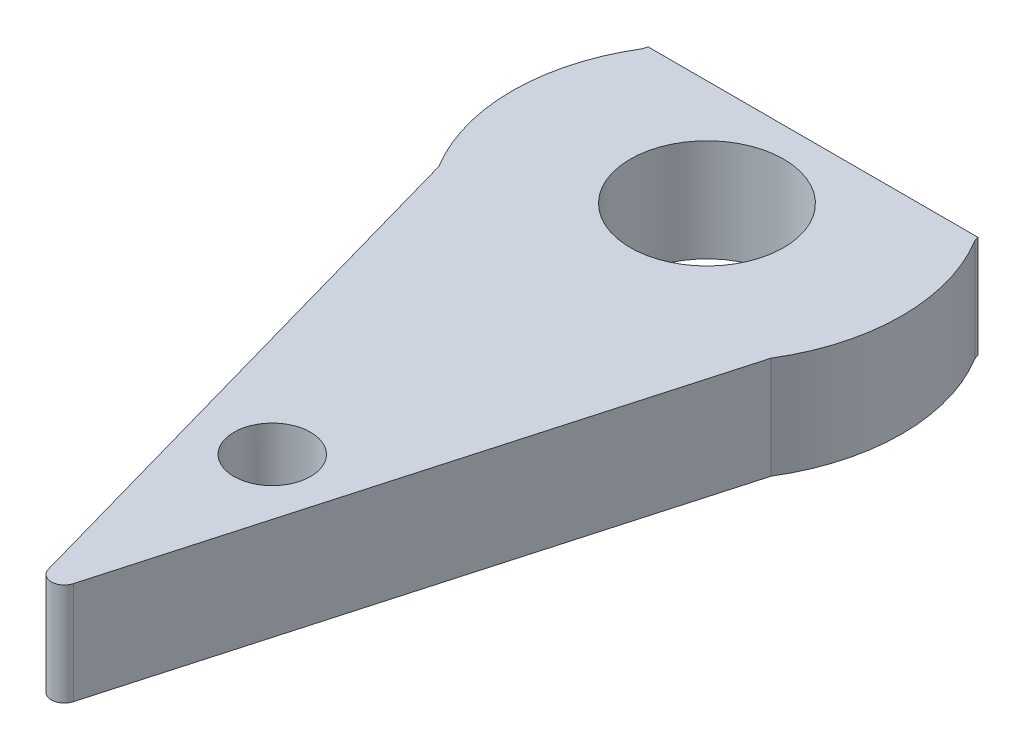
ISO-10303-21;
HEADER;
FILE_DESCRIPTION(('STEP AP214'),'2;1');
FILE_NAME('part.step','',(''),(''),'','','');
FILE_SCHEMA(('AUTOMOTIVE_DESIGN { 1 0 10303 214 1 1 1 1 }'));
ENDSEC;
DATA;
#1=APPLICATION_CONTEXT('core data for automotive mechanical design processes');
#2=APPLICATION_PROTOCOL_DEFINITION('international standard','automotive_design',2000,#1);
#3=PRODUCT_CONTEXT('',#1,'mechanical');
#4=PRODUCT('Part','Part','',(#3));
#5=PRODUCT_RELATED_PRODUCT_CATEGORY('part','',(#4));
#6=PRODUCT_DEFINITION_FORMATION('','',#4);
#7=PRODUCT_DEFINITION_CONTEXT('part definition',#1,'design');
#8=PRODUCT_DEFINITION('design','',#6,#7);
#9=PRODUCT_DEFINITION_SHAPE('','',#8);
#10=(LENGTH_UNIT() NAMED_UNIT(*) SI_UNIT(.MILLI.,.METRE.));
#11=(NAMED_UNIT(*) PLANE_ANGLE_UNIT() SI_UNIT($,.RADIAN.));
#12=(NAMED_UNIT(*) SI_UNIT($,.STERADIAN.) SOLID_ANGLE_UNIT());
#13=UNCERTAINTY_MEASURE_WITH_UNIT(LENGTH_MEASURE(1.E-05),#10,'distance_accuracy_value','');
#14=(GEOMETRIC_REPRESENTATION_CONTEXT(3) GLOBAL_UNCERTAINTY_ASSIGNED_CONTEXT((#13)) GLOBAL_UNIT_ASSIGNED_CONTEXT((#10,
#11,#12)) REPRESENTATION_CONTEXT('',''));
#15=CARTESIAN_POINT('',(0.,0.,0.));
#16=DIRECTION('',(0.,0.,1.));
#17=DIRECTION('',(1.,0.,0.));
#18=AXIS2_PLACEMENT_3D('',#15,#16,#17);
#19=CARTESIAN_POINT('',(0.,2.,0.));
#20=DIRECTION('',(0.,1.,0.));
#21=DIRECTION('',(0.,0.,1.));
#22=AXIS2_PLACEMENT_3D('',#19,#20,#21);
#23=PLANE('',#22);
#24=CARTESIAN_POINT('',(0.,2.,8.5));
#25=DIRECTION('',(0.,1.,0.));
#26=DIRECTION('',(0.,0.,-1.));
#27=AXIS2_PLACEMENT_3D('',#24,#25,#26);
#28=CIRCLE('',#27,0.75);
#29=CARTESIAN_POINT('',(0.,2.,7.75));
#30=VERTEX_POINT('',#29);
#31=EDGE_CURVE('E311',#30,#30,#28,.T.);
#32=ORIENTED_EDGE('',*,*,#31,.F.);
#33=EDGE_LOOP('',(#32));
#34=FACE_BOUND('',#33,.T.);
#35=CARTESIAN_POINT('',(0.,2.,0.));
#36=DIRECTION('',(0.,-1.,0.));
#37=DIRECTION('',(0.,0.,-1.));
#38=AXIS2_PLACEMENT_3D('',#35,#36,#37);
#39=CIRCLE('',#38,1.5);
#40=CARTESIAN_POINT('',(0.,2.,-1.5));
#41=VERTEX_POINT('',#40);
#42=EDGE_CURVE('E306',#41,#41,#39,.T.);
#43=ORIENTED_EDGE('',*,*,#42,.T.);
#44=EDGE_LOOP('',(#43));
#45=FACE_BOUND('',#44,.T.);
#46=DIRECTION('',(-0.271612552445606,0.,-0.962406681893878));
#47=VECTOR('',#46,1.);
#48=CARTESIAN_POINT('',(3.52892342735868,2.,-0.995940611721226));
#49=LINE('',#48,#47);
#50=CARTESIAN_POINT('',(3.24784685471735,2.,-1.99188122344245));
#51=VERTEX_POINT('',#50);
#52=CARTESIAN_POINT('',(3.2243272897343,2.,-2.07521826472098));
#53=VERTEX_POINT('',#52);
#54=EDGE_CURVE('E131',#51,#53,#49,.T.);
#55=ORIENTED_EDGE('',*,*,#54,.T.);
#56=DIRECTION('',(-1.,0.,0.));
#57=VECTOR('',#56,1.);
#58=CARTESIAN_POINT('',(0.,2.,-2.07521826472098));
#59=LINE('',#58,#57);
#60=CARTESIAN_POINT('',(-3.2243272897343,2.,-2.07521826472098));
#61=VERTEX_POINT('',#60);
#62=EDGE_CURVE('E103',#53,#61,#59,.T.);
#63=ORIENTED_EDGE('',*,*,#62,.T.);
#64=DIRECTION('',(-0.271612552445606,0.,0.962406681893878));
#65=VECTOR('',#64,1.);
#66=CARTESIAN_POINT('',(-3.52892342735868,2.,-0.995940611721226));
#67=LINE('',#66,#65);
#68=CARTESIAN_POINT('',(-3.24784685471735,2.,-1.99188122344245));
#69=VERTEX_POINT('',#68);
#70=EDGE_CURVE('E133',#61,#69,#67,.T.);
#71=ORIENTED_EDGE('',*,*,#70,.T.);
#72=CARTESIAN_POINT('',(0.,2.,0.));
#73=DIRECTION('',(0.,1.,0.));
#74=DIRECTION('',(0.,0.,1.));
#75=AXIS2_PLACEMENT_3D('',#72,#73,#74);
#76=CIRCLE('',#75,3.81);
#77=CARTESIAN_POINT('',(-3.24784685471735,2.,1.99188122344245));
#78=VERTEX_POINT('',#77);
#79=EDGE_CURVE('E156',#69,#78,#76,.T.);
#80=ORIENTED_EDGE('',*,*,#79,.T.);
#81=DIRECTION('',(-0.271612552445606,0.,-0.962406681893878));
#82=VECTOR('',#81,1.);
#83=CARTESIAN_POINT('',(-3.52892342735868,2.,0.995940611721226));
#84=LINE('',#83,#82);
#85=CARTESIAN_POINT('',(-0.244451297201043,2.,12.6338339862955));
#86=VERTEX_POINT('',#85);
#87=EDGE_CURVE('E145',#86,#78,#84,.T.);
#88=ORIENTED_EDGE('',*,*,#87,.F.);
#89=CARTESIAN_POINT('',(0.,2.,12.5648443979743));
#90=DIRECTION('',(0.,1.,0.));
#91=DIRECTION('',(0.,0.,1.));
#92=AXIS2_PLACEMENT_3D('',#89,#90,#91);
#93=CIRCLE('',#92,0.254);
#94=CARTESIAN_POINT('',(0.244451297201043,2.,12.6338339862955));
#95=VERTEX_POINT('',#94);
#96=EDGE_CURVE('E161',#86,#95,#93,.T.);
#97=ORIENTED_EDGE('',*,*,#96,.T.);
#98=DIRECTION('',(-0.271612552445606,0.,0.962406681893878));
#99=VECTOR('',#98,1.);
#100=CARTESIAN_POINT('',(3.52892342735868,2.,0.995940611721226));
#101=LINE('',#100,#99);
#102=CARTESIAN_POINT('',(3.24784685471735,2.,1.99188122344245));
#103=VERTEX_POINT('',#102);
#104=EDGE_CURVE('E123',#103,#95,#101,.T.);
#105=ORIENTED_EDGE('',*,*,#104,.F.);
#106=EDGE_CURVE('E152',#103,#51,#76,.T.);
#107=ORIENTED_EDGE('',*,*,#106,.T.);
#108=EDGE_LOOP('',(#55,#63,#71,#80,#88,#97,#105,#107));
#109=FACE_BOUND('',#108,.T.);
#110=ADVANCED_FACE('F37',(#34,#45,#109),#23,.T.);
#111=CARTESIAN_POINT('',(0.,0.,0.));
#112=DIRECTION('',(0.,1.,0.));
#113=DIRECTION('',(0.,0.,1.));
#114=AXIS2_PLACEMENT_3D('',#111,#112,#113);
#115=PLANE('',#114);
#116=CARTESIAN_POINT('',(0.,0.,8.5));
#117=DIRECTION('',(0.,1.,0.));
#118=DIRECTION('',(0.,0.,1.));
#119=AXIS2_PLACEMENT_3D('',#116,#117,#118);
#120=CIRCLE('',#119,0.75);
#121=CARTESIAN_POINT('',(0.,0.,9.25));
#122=VERTEX_POINT('',#121);
#123=EDGE_CURVE('E129',#122,#122,#120,.F.);
#124=ORIENTED_EDGE('',*,*,#123,.F.);
#125=EDGE_LOOP('',(#124));
#126=FACE_BOUND('',#125,.T.);
#127=CARTESIAN_POINT('',(0.,0.,0.));
#128=DIRECTION('',(0.,-1.,0.));
#129=DIRECTION('',(0.,0.,-1.));
#130=AXIS2_PLACEMENT_3D('',#127,#128,#129);
#131=CIRCLE('',#130,1.5);
#132=CARTESIAN_POINT('',(0.,0.,-1.5));
#133=VERTEX_POINT('',#132);
#134=EDGE_CURVE('E108',#133,#133,#131,.T.);
#135=ORIENTED_EDGE('',*,*,#134,.F.);
#136=EDGE_LOOP('',(#135));
#137=FACE_BOUND('',#136,.T.);
#138=DIRECTION('',(1.,0.,0.));
#139=VECTOR('',#138,1.);
#140=CARTESIAN_POINT('',(5.4306501931921,0.,-2.07521826472098));
#141=LINE('',#140,#139);
#142=CARTESIAN_POINT('',(-3.2243272897343,0.,-2.07521826472098));
#143=VERTEX_POINT('',#142);
#144=CARTESIAN_POINT('',(3.2243272897343,0.,-2.07521826472098));
#145=VERTEX_POINT('',#144);
#146=EDGE_CURVE('E52',#143,#145,#141,.T.);
#147=ORIENTED_EDGE('',*,*,#146,.T.);
#148=DIRECTION('',(0.271612552445605,0.,0.962406681893878));
#149=VECTOR('',#148,1.);
#150=CARTESIAN_POINT('',(3.52892342735868,0.,-0.995940611721226));
#151=LINE('',#150,#149);
#152=CARTESIAN_POINT('',(3.24784685471735,0.,-1.99188122344245));
#153=VERTEX_POINT('',#152);
#154=EDGE_CURVE('E114',#145,#153,#151,.T.);
#155=ORIENTED_EDGE('',*,*,#154,.T.);
#156=CARTESIAN_POINT('',(0.,0.,0.));
#157=DIRECTION('',(0.,1.,0.));
#158=DIRECTION('',(0.,0.,1.));
#159=AXIS2_PLACEMENT_3D('',#156,#157,#158);
#160=CIRCLE('',#159,3.81);
#161=CARTESIAN_POINT('',(3.24784685471735,0.,1.99188122344245));
#162=VERTEX_POINT('',#161);
#163=EDGE_CURVE('E157',#162,#153,#160,.T.);
#164=ORIENTED_EDGE('',*,*,#163,.F.);
#165=DIRECTION('',(0.271612552445605,0.,-0.962406681893878));
#166=VECTOR('',#165,1.);
#167=CARTESIAN_POINT('',(3.52892342735868,0.,0.995940611721226));
#168=LINE('',#167,#166);
#169=CARTESIAN_POINT('',(0.244451297201044,0.,12.6338339862955));
#170=VERTEX_POINT('',#169);
#171=EDGE_CURVE('E140',#170,#162,#168,.T.);
#172=ORIENTED_EDGE('',*,*,#171,.F.);
#173=CARTESIAN_POINT('',(0.,0.,12.5648443979743));
#174=DIRECTION('',(0.,1.,0.));
#175=DIRECTION('',(0.,0.,1.));
#176=AXIS2_PLACEMENT_3D('',#173,#174,#175);
#177=CIRCLE('',#176,0.254);
#178=CARTESIAN_POINT('',(-0.244451297201044,0.,12.6338339862955));
#179=VERTEX_POINT('',#178);
#180=EDGE_CURVE('E45',#170,#179,#177,.F.);
#181=ORIENTED_EDGE('',*,*,#180,.T.);
#182=DIRECTION('',(0.271612552445605,0.,0.962406681893878));
#183=VECTOR('',#182,1.);
#184=CARTESIAN_POINT('',(-3.52892342735868,0.,0.995940611721226));
#185=LINE('',#184,#183);
#186=CARTESIAN_POINT('',(-3.24784685471735,0.,1.99188122344245));
#187=VERTEX_POINT('',#186);
#188=EDGE_CURVE('E137',#187,#179,#185,.T.);
#189=ORIENTED_EDGE('',*,*,#188,.F.);
#190=CARTESIAN_POINT('',(-3.24784685471735,0.,-1.99188122344245));
#191=VERTEX_POINT('',#190);
#192=EDGE_CURVE('E143',#191,#187,#160,.T.);
#193=ORIENTED_EDGE('',*,*,#192,.F.);
#194=DIRECTION('',(0.271612552445605,0.,-0.962406681893878));
#195=VECTOR('',#194,1.);
#196=CARTESIAN_POINT('',(-3.52892342735868,0.,-0.995940611721226));
#197=LINE('',#196,#195);
#198=EDGE_CURVE('E117',#191,#143,#197,.T.);
#199=ORIENTED_EDGE('',*,*,#198,.T.);
#200=EDGE_LOOP('',(#147,#155,#164,#172,#181,#189,#193,#199));
#201=FACE_BOUND('',#200,.T.);
#202=ADVANCED_FACE('F112',(#126,#137,#201),#115,.F.);
#203=CARTESIAN_POINT('',(3.52892342735868,-13.2147960461804,-0.995940611721226));
#204=DIRECTION('',(0.962406681893878,0.,-0.271612552445605));
#205=DIRECTION('',(-0.271612552445605,0.,-0.962406681893878));
#206=AXIS2_PLACEMENT_3D('',#203,#204,#205);
#207=PLANE('',#206);
#208=ORIENTED_EDGE('',*,*,#154,.F.);
#209=DIRECTION('',(0.,1.,0.));
#210=VECTOR('',#209,1.);
#211=CARTESIAN_POINT('',(3.2243272897343,-13.2147960461804,-2.07521826472098));
#212=LINE('',#211,#210);
#213=EDGE_CURVE('E100',#145,#53,#212,.T.);
#214=ORIENTED_EDGE('',*,*,#213,.T.);
#215=ORIENTED_EDGE('',*,*,#54,.F.);
#216=DIRECTION('',(0.,1.,0.));
#217=VECTOR('',#216,1.);
#218=CARTESIAN_POINT('',(3.24784685471735,-13.2147960461804,-1.99188122344245));
#219=LINE('',#218,#217);
#220=EDGE_CURVE('E121',#153,#51,#219,.T.);
#221=ORIENTED_EDGE('',*,*,#220,.F.);
#222=EDGE_LOOP('',(#208,#214,#215,#221));
#223=FACE_BOUND('',#222,.T.);
#224=ADVANCED_FACE('F120',(#223),#207,.T.);
#225=CARTESIAN_POINT('',(-3.52892342735868,-13.2147960461804,-0.995940611721226));
#226=DIRECTION('',(-0.962406681893878,0.,-0.271612552445605));
#227=DIRECTION('',(-0.271612552445605,0.,0.962406681893878));
#228=AXIS2_PLACEMENT_3D('',#225,#226,#227);
#229=PLANE('',#228);
#230=ORIENTED_EDGE('',*,*,#70,.F.);
#231=DIRECTION('',(0.,-1.,0.));
#232=VECTOR('',#231,1.);
#233=CARTESIAN_POINT('',(-3.2243272897343,-13.2147960461804,-2.07521826472098));
#234=LINE('',#233,#232);
#235=EDGE_CURVE('E11',#61,#143,#234,.T.);
#236=ORIENTED_EDGE('',*,*,#235,.T.);
#237=ORIENTED_EDGE('',*,*,#198,.F.);
#238=DIRECTION('',(0.,1.,0.));
#239=VECTOR('',#238,1.);
#240=CARTESIAN_POINT('',(-3.24784685471735,-13.2147960461804,-1.99188122344245));
#241=LINE('',#240,#239);
#242=EDGE_CURVE('E125',#191,#69,#241,.T.);
#243=ORIENTED_EDGE('',*,*,#242,.T.);
#244=EDGE_LOOP('',(#230,#236,#237,#243));
#245=FACE_BOUND('',#244,.T.);
#246=ADVANCED_FACE('F182',(#245),#229,.T.);
#247=CARTESIAN_POINT('',(0.,2.,0.));
#248=DIRECTION('',(0.,-1.,0.));
#249=DIRECTION('',(0.,0.,-1.));
#250=AXIS2_PLACEMENT_3D('',#247,#248,#249);
#251=CYLINDRICAL_SURFACE('',#250,3.81);
#252=ORIENTED_EDGE('',*,*,#163,.T.);
#253=ORIENTED_EDGE('',*,*,#220,.T.);
#254=ORIENTED_EDGE('',*,*,#106,.F.);
#255=DIRECTION('',(0.,1.,0.));
#256=VECTOR('',#255,1.);
#257=CARTESIAN_POINT('',(3.24784685471735,-13.2147960461804,1.99188122344245));
#258=LINE('',#257,#256);
#259=EDGE_CURVE('E147',#162,#103,#258,.T.);
#260=ORIENTED_EDGE('',*,*,#259,.F.);
#261=EDGE_LOOP('',(#252,#253,#254,#260));
#262=FACE_BOUND('',#261,.T.);
#263=ADVANCED_FACE('F177',(#262),#251,.T.);
#264=ORIENTED_EDGE('',*,*,#79,.F.);
#265=ORIENTED_EDGE('',*,*,#242,.F.);
#266=ORIENTED_EDGE('',*,*,#192,.T.);
#267=DIRECTION('',(0.,1.,0.));
#268=VECTOR('',#267,1.);
#269=CARTESIAN_POINT('',(-3.24784685471735,-13.2147960461804,1.99188122344245));
#270=LINE('',#269,#268);
#271=EDGE_CURVE('E141',#187,#78,#270,.T.);
#272=ORIENTED_EDGE('',*,*,#271,.T.);
#273=EDGE_LOOP('',(#264,#265,#266,#272));
#274=FACE_BOUND('',#273,.T.);
#275=ADVANCED_FACE('F185',(#274),#251,.T.);
#276=CARTESIAN_POINT('',(-3.52892342735868,-13.2147960461804,0.995940611721226));
#277=DIRECTION('',(0.962406681893878,0.,-0.271612552445605));
#278=DIRECTION('',(-0.271612552445605,0.,-0.962406681893878));
#279=AXIS2_PLACEMENT_3D('',#276,#277,#278);
#280=PLANE('',#279);
#281=ORIENTED_EDGE('',*,*,#188,.T.);
#282=DIRECTION('',(0.,1.,0.));
#283=VECTOR('',#282,1.);
#284=CARTESIAN_POINT('',(-0.244451297201044,-13.2147960461804,12.6338339862955));
#285=LINE('',#284,#283);
#286=EDGE_CURVE('E155',#179,#86,#285,.T.);
#287=ORIENTED_EDGE('',*,*,#286,.T.);
#288=ORIENTED_EDGE('',*,*,#87,.T.);
#289=ORIENTED_EDGE('',*,*,#271,.F.);
#290=EDGE_LOOP('',(#281,#287,#288,#289));
#291=FACE_BOUND('',#290,.T.);
#292=ADVANCED_FACE('F169',(#291),#280,.F.);
#293=CARTESIAN_POINT('',(3.52892342735868,-13.2147960461804,0.995940611721226));
#294=DIRECTION('',(-0.962406681893878,0.,-0.271612552445605));
#295=DIRECTION('',(-0.271612552445605,0.,0.962406681893878));
#296=AXIS2_PLACEMENT_3D('',#293,#294,#295);
#297=PLANE('',#296);
#298=ORIENTED_EDGE('',*,*,#104,.T.);
#299=DIRECTION('',(0.,1.,0.));
#300=VECTOR('',#299,1.);
#301=CARTESIAN_POINT('',(0.244451297201044,-13.2147960461804,12.6338339862955));
#302=LINE('',#301,#300);
#303=EDGE_CURVE('E59',#95,#170,#302,.F.);
#304=ORIENTED_EDGE('',*,*,#303,.T.);
#305=ORIENTED_EDGE('',*,*,#171,.T.);
#306=ORIENTED_EDGE('',*,*,#259,.T.);
#307=EDGE_LOOP('',(#298,#304,#305,#306));
#308=FACE_BOUND('',#307,.T.);
#309=ADVANCED_FACE('F174',(#308),#297,.F.);
#310=CARTESIAN_POINT('',(0.,-13.2147960461804,12.5648443979743));
#311=DIRECTION('',(0.,1.,0.));
#312=DIRECTION('',(0.,0.,1.));
#313=AXIS2_PLACEMENT_3D('',#310,#311,#312);
#314=CYLINDRICAL_SURFACE('',#313,0.254);
#315=ORIENTED_EDGE('',*,*,#180,.F.);
#316=ORIENTED_EDGE('',*,*,#303,.F.);
#317=ORIENTED_EDGE('',*,*,#96,.F.);
#318=ORIENTED_EDGE('',*,*,#286,.F.);
#319=EDGE_LOOP('',(#315,#316,#317,#318));
#320=FACE_BOUND('',#319,.T.);
#321=ADVANCED_FACE('F39',(#320),#314,.T.);
#322=CARTESIAN_POINT('',(0.,-2.12132034355964,8.5));
#323=DIRECTION('',(0.,1.,0.));
#324=DIRECTION('',(0.,0.,1.));
#325=AXIS2_PLACEMENT_3D('',#322,#323,#324);
#326=CYLINDRICAL_SURFACE('',#325,0.75);
#327=ORIENTED_EDGE('',*,*,#123,.T.);
#328=EDGE_LOOP('',(#327));
#329=FACE_BOUND('',#328,.T.);
#330=ORIENTED_EDGE('',*,*,#31,.T.);
#331=EDGE_LOOP('',(#330));
#332=FACE_BOUND('',#331,.T.);
#333=ADVANCED_FACE('F209',(#329,#332),#326,.F.);
#334=CARTESIAN_POINT('',(0.,2.,0.));
#335=DIRECTION('',(0.,-1.,0.));
#336=DIRECTION('',(0.,0.,-1.));
#337=AXIS2_PLACEMENT_3D('',#334,#335,#336);
#338=CYLINDRICAL_SURFACE('',#337,1.5);
#339=ORIENTED_EDGE('',*,*,#42,.F.);
#340=EDGE_LOOP('',(#339));
#341=FACE_BOUND('',#340,.T.);
#342=ORIENTED_EDGE('',*,*,#134,.T.);
#343=EDGE_LOOP('',(#342));
#344=FACE_BOUND('',#343,.T.);
#345=ADVANCED_FACE('F212',(#341,#344),#338,.F.);
#346=CARTESIAN_POINT('',(5.4306501931921,2.54,-2.07521826472098));
#347=DIRECTION('',(0.,0.,-1.));
#348=DIRECTION('',(-1.,0.,0.));
#349=AXIS2_PLACEMENT_3D('',#346,#347,#348);
#350=PLANE('',#349);
#351=ORIENTED_EDGE('',*,*,#146,.F.);
#352=ORIENTED_EDGE('',*,*,#235,.F.);
#353=ORIENTED_EDGE('',*,*,#62,.F.);
#354=ORIENTED_EDGE('',*,*,#213,.F.);
#355=EDGE_LOOP('',(#351,#352,#353,#354));
#356=FACE_BOUND('',#355,.T.);
#357=ADVANCED_FACE('F101',(#356),#350,.T.);
#358=CLOSED_SHELL('',(#110,#202,#224,#246,#263,#275,#292,#309,#321,#333,#345,#357));
#359=MANIFOLD_SOLID_BREP('B2',#358);
#360=ADVANCED_BREP_SHAPE_REPRESENTATION('',(#18,#359),#14);
#361=SHAPE_DEFINITION_REPRESENTATION(#9,#360);
ENDSEC;
END-ISO-10303-21;
